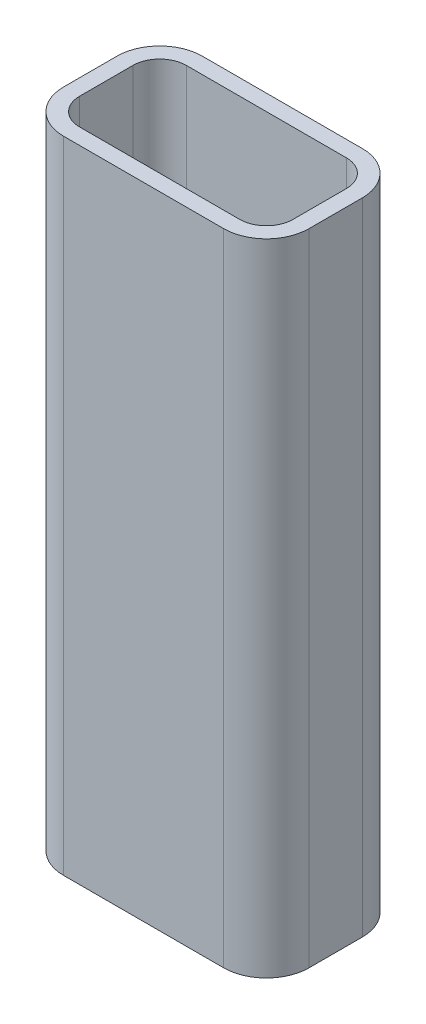
ISO-10303-21;
HEADER;
FILE_DESCRIPTION(('STEP AP214'),'2;1');
FILE_NAME('part.step','',(''),(''),'','','');
FILE_SCHEMA(('AUTOMOTIVE_DESIGN { 1 0 10303 214 1 1 1 1 }'));
ENDSEC;
DATA;
#1=APPLICATION_CONTEXT('core data for automotive mechanical design processes');
#2=APPLICATION_PROTOCOL_DEFINITION('international standard','automotive_design',2000,#1);
#3=PRODUCT_CONTEXT('',#1,'mechanical');
#4=PRODUCT('Part','Part','',(#3));
#5=PRODUCT_RELATED_PRODUCT_CATEGORY('part','',(#4));
#6=PRODUCT_DEFINITION_FORMATION('','',#4);
#7=PRODUCT_DEFINITION_CONTEXT('part definition',#1,'design');
#8=PRODUCT_DEFINITION('design','',#6,#7);
#9=PRODUCT_DEFINITION_SHAPE('','',#8);
#10=(LENGTH_UNIT() NAMED_UNIT(*) SI_UNIT(.MILLI.,.METRE.));
#11=(NAMED_UNIT(*) PLANE_ANGLE_UNIT() SI_UNIT($,.RADIAN.));
#12=(NAMED_UNIT(*) SI_UNIT($,.STERADIAN.) SOLID_ANGLE_UNIT());
#13=UNCERTAINTY_MEASURE_WITH_UNIT(LENGTH_MEASURE(1.E-05),#10,'distance_accuracy_value','');
#14=(GEOMETRIC_REPRESENTATION_CONTEXT(3) GLOBAL_UNCERTAINTY_ASSIGNED_CONTEXT((#13)) GLOBAL_UNIT_ASSIGNED_CONTEXT((#10,
#11,#12)) REPRESENTATION_CONTEXT('',''));
#15=CARTESIAN_POINT('',(0.,0.,0.));
#16=DIRECTION('',(0.,0.,1.));
#17=DIRECTION('',(1.,0.,0.));
#18=AXIS2_PLACEMENT_3D('',#15,#16,#17);
#19=CARTESIAN_POINT('',(15.,60.,5.));
#20=DIRECTION('',(0.,1.,0.));
#21=DIRECTION('',(0.,0.,1.));
#22=AXIS2_PLACEMENT_3D('',#19,#20,#21);
#23=PLANE('',#22);
#24=CARTESIAN_POINT('',(15.,60.,5.));
#25=DIRECTION('',(0.,1.,0.));
#26=DIRECTION('',(1.,0.,0.));
#27=AXIS2_PLACEMENT_3D('',#24,#25,#26);
#28=CIRCLE('',#27,8.);
#29=CARTESIAN_POINT('',(15.,60.,13.));
#30=VERTEX_POINT('',#29);
#31=CARTESIAN_POINT('',(23.,60.,5.));
#32=VERTEX_POINT('',#31);
#33=EDGE_CURVE('E290',#30,#32,#28,.T.);
#34=ORIENTED_EDGE('',*,*,#33,.T.);
#35=DIRECTION('',(0.,0.,-1.));
#36=VECTOR('',#35,1.);
#37=CARTESIAN_POINT('',(23.,60.,5.));
#38=LINE('',#37,#36);
#39=CARTESIAN_POINT('',(23.,60.,-5.));
#40=VERTEX_POINT('',#39);
#41=EDGE_CURVE('E294',#32,#40,#38,.T.);
#42=ORIENTED_EDGE('',*,*,#41,.T.);
#43=CARTESIAN_POINT('',(15.,60.,-5.));
#44=DIRECTION('',(0.,1.,0.));
#45=DIRECTION('',(1.,0.,0.));
#46=AXIS2_PLACEMENT_3D('',#43,#44,#45);
#47=CIRCLE('',#46,8.);
#48=CARTESIAN_POINT('',(15.,60.,-13.));
#49=VERTEX_POINT('',#48);
#50=EDGE_CURVE('E298',#40,#49,#47,.T.);
#51=ORIENTED_EDGE('',*,*,#50,.T.);
#52=DIRECTION('',(-1.,0.,0.));
#53=VECTOR('',#52,1.);
#54=CARTESIAN_POINT('',(-15.,60.,-13.));
#55=LINE('',#54,#53);
#56=CARTESIAN_POINT('',(-15.,60.,-13.));
#57=VERTEX_POINT('',#56);
#58=EDGE_CURVE('E301',#49,#57,#55,.T.);
#59=ORIENTED_EDGE('',*,*,#58,.T.);
#60=CARTESIAN_POINT('',(-15.,60.,-5.));
#61=DIRECTION('',(0.,1.,0.));
#62=DIRECTION('',(1.,0.,0.));
#63=AXIS2_PLACEMENT_3D('',#60,#61,#62);
#64=CIRCLE('',#63,8.);
#65=CARTESIAN_POINT('',(-23.,60.,-5.));
#66=VERTEX_POINT('',#65);
#67=EDGE_CURVE('E304',#57,#66,#64,.T.);
#68=ORIENTED_EDGE('',*,*,#67,.T.);
#69=DIRECTION('',(0.,0.,1.));
#70=VECTOR('',#69,1.);
#71=CARTESIAN_POINT('',(-23.,60.,5.));
#72=LINE('',#71,#70);
#73=CARTESIAN_POINT('',(-23.,60.,5.));
#74=VERTEX_POINT('',#73);
#75=EDGE_CURVE('E307',#66,#74,#72,.T.);
#76=ORIENTED_EDGE('',*,*,#75,.T.);
#77=CARTESIAN_POINT('',(-15.,60.,5.));
#78=DIRECTION('',(0.,1.,0.));
#79=DIRECTION('',(1.,0.,0.));
#80=AXIS2_PLACEMENT_3D('',#77,#78,#79);
#81=CIRCLE('',#80,8.);
#82=CARTESIAN_POINT('',(-15.,60.,13.));
#83=VERTEX_POINT('',#82);
#84=EDGE_CURVE('E310',#74,#83,#81,.T.);
#85=ORIENTED_EDGE('',*,*,#84,.T.);
#86=DIRECTION('',(1.,0.,0.));
#87=VECTOR('',#86,1.);
#88=CARTESIAN_POINT('',(-15.,60.,13.));
#89=LINE('',#88,#87);
#90=EDGE_CURVE('E313',#83,#30,#89,.T.);
#91=ORIENTED_EDGE('',*,*,#90,.T.);
#92=EDGE_LOOP('',(#34,#42,#51,#59,#68,#76,#85,#91));
#93=FACE_BOUND('',#92,.T.);
#94=DIRECTION('',(0.,0.,-1.));
#95=VECTOR('',#94,1.);
#96=CARTESIAN_POINT('',(20.,60.,5.));
#97=LINE('',#96,#95);
#98=CARTESIAN_POINT('',(20.,60.,5.));
#99=VERTEX_POINT('',#98);
#100=CARTESIAN_POINT('',(20.,60.,-5.));
#101=VERTEX_POINT('',#100);
#102=EDGE_CURVE('E210',#99,#101,#97,.T.);
#103=ORIENTED_EDGE('',*,*,#102,.F.);
#104=CARTESIAN_POINT('',(15.,60.,5.));
#105=DIRECTION('',(0.,1.,0.));
#106=DIRECTION('',(0.,0.,1.));
#107=AXIS2_PLACEMENT_3D('',#104,#105,#106);
#108=CIRCLE('',#107,5.);
#109=CARTESIAN_POINT('',(15.,60.,10.));
#110=VERTEX_POINT('',#109);
#111=EDGE_CURVE('E201',#110,#99,#108,.T.);
#112=ORIENTED_EDGE('',*,*,#111,.F.);
#113=DIRECTION('',(1.,0.,0.));
#114=VECTOR('',#113,1.);
#115=CARTESIAN_POINT('',(-15.,60.,10.));
#116=LINE('',#115,#114);
#117=CARTESIAN_POINT('',(-15.,60.,10.));
#118=VERTEX_POINT('',#117);
#119=EDGE_CURVE('E242',#118,#110,#116,.T.);
#120=ORIENTED_EDGE('',*,*,#119,.F.);
#121=CARTESIAN_POINT('',(-15.,60.,5.));
#122=DIRECTION('',(0.,1.,0.));
#123=DIRECTION('',(0.,0.,-1.));
#124=AXIS2_PLACEMENT_3D('',#121,#122,#123);
#125=CIRCLE('',#124,5.);
#126=CARTESIAN_POINT('',(-20.,60.,5.));
#127=VERTEX_POINT('',#126);
#128=EDGE_CURVE('E239',#127,#118,#125,.T.);
#129=ORIENTED_EDGE('',*,*,#128,.F.);
#130=DIRECTION('',(0.,0.,1.));
#131=VECTOR('',#130,1.);
#132=CARTESIAN_POINT('',(-20.,60.,5.));
#133=LINE('',#132,#131);
#134=CARTESIAN_POINT('',(-20.,60.,-5.));
#135=VERTEX_POINT('',#134);
#136=EDGE_CURVE('E236',#135,#127,#133,.T.);
#137=ORIENTED_EDGE('',*,*,#136,.F.);
#138=CARTESIAN_POINT('',(-15.,60.,-5.));
#139=DIRECTION('',(0.,1.,0.));
#140=DIRECTION('',(0.,0.,-1.));
#141=AXIS2_PLACEMENT_3D('',#138,#139,#140);
#142=CIRCLE('',#141,5.);
#143=CARTESIAN_POINT('',(-15.,60.,-10.));
#144=VERTEX_POINT('',#143);
#145=EDGE_CURVE('E233',#144,#135,#142,.T.);
#146=ORIENTED_EDGE('',*,*,#145,.F.);
#147=DIRECTION('',(-1.,0.,0.));
#148=VECTOR('',#147,1.);
#149=CARTESIAN_POINT('',(-15.,60.,-10.));
#150=LINE('',#149,#148);
#151=CARTESIAN_POINT('',(15.,60.,-10.));
#152=VERTEX_POINT('',#151);
#153=EDGE_CURVE('E228',#152,#144,#150,.T.);
#154=ORIENTED_EDGE('',*,*,#153,.F.);
#155=CARTESIAN_POINT('',(15.,60.,-5.));
#156=DIRECTION('',(0.,1.,0.));
#157=DIRECTION('',(0.,0.,-1.));
#158=AXIS2_PLACEMENT_3D('',#155,#156,#157);
#159=CIRCLE('',#158,5.);
#160=EDGE_CURVE('E224',#101,#152,#159,.T.);
#161=ORIENTED_EDGE('',*,*,#160,.F.);
#162=EDGE_LOOP('',(#103,#112,#120,#129,#137,#146,#154,#161));
#163=FACE_BOUND('',#162,.T.);
#164=ADVANCED_FACE('F87',(#93,#163),#23,.T.);
#165=CARTESIAN_POINT('',(15.,-60.,5.));
#166=DIRECTION('',(0.,1.,0.));
#167=DIRECTION('',(0.,0.,1.));
#168=AXIS2_PLACEMENT_3D('',#165,#166,#167);
#169=PLANE('',#168);
#170=CARTESIAN_POINT('',(15.,-60.,5.));
#171=DIRECTION('',(0.,1.,0.));
#172=DIRECTION('',(1.,0.,0.));
#173=AXIS2_PLACEMENT_3D('',#170,#171,#172);
#174=CIRCLE('',#173,8.);
#175=CARTESIAN_POINT('',(15.,-60.,13.));
#176=VERTEX_POINT('',#175);
#177=CARTESIAN_POINT('',(23.,-60.,5.));
#178=VERTEX_POINT('',#177);
#179=EDGE_CURVE('E219',#176,#178,#174,.T.);
#180=ORIENTED_EDGE('',*,*,#179,.F.);
#181=DIRECTION('',(1.,0.,0.));
#182=VECTOR('',#181,1.);
#183=CARTESIAN_POINT('',(-15.,-60.,13.));
#184=LINE('',#183,#182);
#185=CARTESIAN_POINT('',(-15.,-60.,13.));
#186=VERTEX_POINT('',#185);
#187=EDGE_CURVE('E295',#186,#176,#184,.T.);
#188=ORIENTED_EDGE('',*,*,#187,.F.);
#189=CARTESIAN_POINT('',(-15.,-60.,5.));
#190=DIRECTION('',(0.,1.,0.));
#191=DIRECTION('',(1.,0.,0.));
#192=AXIS2_PLACEMENT_3D('',#189,#190,#191);
#193=CIRCLE('',#192,8.);
#194=CARTESIAN_POINT('',(-23.,-60.,5.));
#195=VERTEX_POINT('',#194);
#196=EDGE_CURVE('E335',#195,#186,#193,.T.);
#197=ORIENTED_EDGE('',*,*,#196,.F.);
#198=DIRECTION('',(0.,0.,1.));
#199=VECTOR('',#198,1.);
#200=CARTESIAN_POINT('',(-23.,-60.,5.));
#201=LINE('',#200,#199);
#202=CARTESIAN_POINT('',(-23.,-60.,-5.));
#203=VERTEX_POINT('',#202);
#204=EDGE_CURVE('E332',#203,#195,#201,.T.);
#205=ORIENTED_EDGE('',*,*,#204,.F.);
#206=CARTESIAN_POINT('',(-15.,-60.,-5.));
#207=DIRECTION('',(0.,1.,0.));
#208=DIRECTION('',(1.,0.,0.));
#209=AXIS2_PLACEMENT_3D('',#206,#207,#208);
#210=CIRCLE('',#209,8.);
#211=CARTESIAN_POINT('',(-15.,-60.,-13.));
#212=VERTEX_POINT('',#211);
#213=EDGE_CURVE('E329',#212,#203,#210,.T.);
#214=ORIENTED_EDGE('',*,*,#213,.F.);
#215=DIRECTION('',(-1.,0.,0.));
#216=VECTOR('',#215,1.);
#217=CARTESIAN_POINT('',(-15.,-60.,-13.));
#218=LINE('',#217,#216);
#219=CARTESIAN_POINT('',(15.,-60.,-13.));
#220=VERTEX_POINT('',#219);
#221=EDGE_CURVE('E326',#220,#212,#218,.T.);
#222=ORIENTED_EDGE('',*,*,#221,.F.);
#223=CARTESIAN_POINT('',(15.,-60.,-5.));
#224=DIRECTION('',(0.,1.,0.));
#225=DIRECTION('',(1.,0.,0.));
#226=AXIS2_PLACEMENT_3D('',#223,#224,#225);
#227=CIRCLE('',#226,8.);
#228=CARTESIAN_POINT('',(23.,-60.,-5.));
#229=VERTEX_POINT('',#228);
#230=EDGE_CURVE('E323',#229,#220,#227,.T.);
#231=ORIENTED_EDGE('',*,*,#230,.F.);
#232=DIRECTION('',(0.,0.,-1.));
#233=VECTOR('',#232,1.);
#234=CARTESIAN_POINT('',(23.,-60.,5.));
#235=LINE('',#234,#233);
#236=EDGE_CURVE('E320',#178,#229,#235,.T.);
#237=ORIENTED_EDGE('',*,*,#236,.F.);
#238=EDGE_LOOP('',(#180,#188,#197,#205,#214,#222,#231,#237));
#239=FACE_BOUND('',#238,.T.);
#240=CARTESIAN_POINT('',(15.,-60.,5.));
#241=DIRECTION('',(0.,1.,0.));
#242=DIRECTION('',(0.,0.,1.));
#243=AXIS2_PLACEMENT_3D('',#240,#241,#242);
#244=CIRCLE('',#243,5.);
#245=CARTESIAN_POINT('',(15.,-60.,10.));
#246=VERTEX_POINT('',#245);
#247=CARTESIAN_POINT('',(20.,-60.,5.));
#248=VERTEX_POINT('',#247);
#249=EDGE_CURVE('E111',#246,#248,#244,.T.);
#250=ORIENTED_EDGE('',*,*,#249,.T.);
#251=DIRECTION('',(0.,0.,-1.));
#252=VECTOR('',#251,1.);
#253=CARTESIAN_POINT('',(20.,-60.,5.));
#254=LINE('',#253,#252);
#255=CARTESIAN_POINT('',(20.,-60.,-5.));
#256=VERTEX_POINT('',#255);
#257=EDGE_CURVE('E217',#248,#256,#254,.T.);
#258=ORIENTED_EDGE('',*,*,#257,.T.);
#259=CARTESIAN_POINT('',(15.,-60.,-5.));
#260=DIRECTION('',(0.,1.,0.));
#261=DIRECTION('',(0.,0.,-1.));
#262=AXIS2_PLACEMENT_3D('',#259,#260,#261);
#263=CIRCLE('',#262,5.);
#264=CARTESIAN_POINT('',(15.,-60.,-10.));
#265=VERTEX_POINT('',#264);
#266=EDGE_CURVE('E249',#256,#265,#263,.T.);
#267=ORIENTED_EDGE('',*,*,#266,.T.);
#268=DIRECTION('',(-1.,0.,0.));
#269=VECTOR('',#268,1.);
#270=CARTESIAN_POINT('',(-15.,-60.,-10.));
#271=LINE('',#270,#269);
#272=CARTESIAN_POINT('',(-15.,-60.,-10.));
#273=VERTEX_POINT('',#272);
#274=EDGE_CURVE('E253',#265,#273,#271,.T.);
#275=ORIENTED_EDGE('',*,*,#274,.T.);
#276=CARTESIAN_POINT('',(-15.,-60.,-5.));
#277=DIRECTION('',(0.,1.,0.));
#278=DIRECTION('',(0.,0.,-1.));
#279=AXIS2_PLACEMENT_3D('',#276,#277,#278);
#280=CIRCLE('',#279,5.);
#281=CARTESIAN_POINT('',(-20.,-60.,-5.));
#282=VERTEX_POINT('',#281);
#283=EDGE_CURVE('E257',#273,#282,#280,.T.);
#284=ORIENTED_EDGE('',*,*,#283,.T.);
#285=DIRECTION('',(0.,0.,1.));
#286=VECTOR('',#285,1.);
#287=CARTESIAN_POINT('',(-20.,-60.,5.));
#288=LINE('',#287,#286);
#289=CARTESIAN_POINT('',(-20.,-60.,5.));
#290=VERTEX_POINT('',#289);
#291=EDGE_CURVE('E261',#282,#290,#288,.T.);
#292=ORIENTED_EDGE('',*,*,#291,.T.);
#293=CARTESIAN_POINT('',(-15.,-60.,5.));
#294=DIRECTION('',(0.,1.,0.));
#295=DIRECTION('',(0.,0.,-1.));
#296=AXIS2_PLACEMENT_3D('',#293,#294,#295);
#297=CIRCLE('',#296,5.);
#298=CARTESIAN_POINT('',(-15.,-60.,10.));
#299=VERTEX_POINT('',#298);
#300=EDGE_CURVE('E265',#290,#299,#297,.T.);
#301=ORIENTED_EDGE('',*,*,#300,.T.);
#302=DIRECTION('',(1.,0.,0.));
#303=VECTOR('',#302,1.);
#304=CARTESIAN_POINT('',(-15.,-60.,10.));
#305=LINE('',#304,#303);
#306=EDGE_CURVE('E211',#299,#246,#305,.T.);
#307=ORIENTED_EDGE('',*,*,#306,.T.);
#308=EDGE_LOOP('',(#250,#258,#267,#275,#284,#292,#301,#307));
#309=FACE_BOUND('',#308,.T.);
#310=ADVANCED_FACE('F374',(#239,#309),#169,.F.);
#311=CARTESIAN_POINT('',(15.,60.,5.));
#312=DIRECTION('',(0.,-1.,0.));
#313=DIRECTION('',(0.,0.,-1.));
#314=AXIS2_PLACEMENT_3D('',#311,#312,#313);
#315=CYLINDRICAL_SURFACE('',#314,8.);
#316=ORIENTED_EDGE('',*,*,#179,.T.);
#317=DIRECTION('',(0.,-1.,0.));
#318=VECTOR('',#317,1.);
#319=CARTESIAN_POINT('',(23.,60.,5.));
#320=LINE('',#319,#318);
#321=EDGE_CURVE('E12',#32,#178,#320,.T.);
#322=ORIENTED_EDGE('',*,*,#321,.F.);
#323=ORIENTED_EDGE('',*,*,#33,.F.);
#324=DIRECTION('',(0.,-1.,0.));
#325=VECTOR('',#324,1.);
#326=CARTESIAN_POINT('',(15.,60.,13.));
#327=LINE('',#326,#325);
#328=EDGE_CURVE('E316',#30,#176,#327,.T.);
#329=ORIENTED_EDGE('',*,*,#328,.T.);
#330=EDGE_LOOP('',(#316,#322,#323,#329));
#331=FACE_BOUND('',#330,.T.);
#332=ADVANCED_FACE('F89',(#331),#315,.T.);
#333=CARTESIAN_POINT('',(23.,60.,5.));
#334=DIRECTION('',(-1.,0.,0.));
#335=DIRECTION('',(0.,0.,1.));
#336=AXIS2_PLACEMENT_3D('',#333,#334,#335);
#337=PLANE('',#336);
#338=ORIENTED_EDGE('',*,*,#236,.T.);
#339=DIRECTION('',(0.,-1.,0.));
#340=VECTOR('',#339,1.);
#341=CARTESIAN_POINT('',(23.,60.,-5.));
#342=LINE('',#341,#340);
#343=EDGE_CURVE('E96',#40,#229,#342,.T.);
#344=ORIENTED_EDGE('',*,*,#343,.F.);
#345=ORIENTED_EDGE('',*,*,#41,.F.);
#346=ORIENTED_EDGE('',*,*,#321,.T.);
#347=EDGE_LOOP('',(#338,#344,#345,#346));
#348=FACE_BOUND('',#347,.T.);
#349=ADVANCED_FACE('F391',(#348),#337,.F.);
#350=CARTESIAN_POINT('',(15.,60.,-5.));
#351=DIRECTION('',(0.,-1.,0.));
#352=DIRECTION('',(0.,0.,-1.));
#353=AXIS2_PLACEMENT_3D('',#350,#351,#352);
#354=CYLINDRICAL_SURFACE('',#353,8.);
#355=ORIENTED_EDGE('',*,*,#230,.T.);
#356=DIRECTION('',(0.,-1.,0.));
#357=VECTOR('',#356,1.);
#358=CARTESIAN_POINT('',(15.,60.,-13.));
#359=LINE('',#358,#357);
#360=EDGE_CURVE('E359',#49,#220,#359,.T.);
#361=ORIENTED_EDGE('',*,*,#360,.F.);
#362=ORIENTED_EDGE('',*,*,#50,.F.);
#363=ORIENTED_EDGE('',*,*,#343,.T.);
#364=EDGE_LOOP('',(#355,#361,#362,#363));
#365=FACE_BOUND('',#364,.T.);
#366=ADVANCED_FACE('F368',(#365),#354,.T.);
#367=CARTESIAN_POINT('',(-15.,60.,-13.));
#368=DIRECTION('',(0.,0.,1.));
#369=DIRECTION('',(1.,0.,0.));
#370=AXIS2_PLACEMENT_3D('',#367,#368,#369);
#371=PLANE('',#370);
#372=ORIENTED_EDGE('',*,*,#221,.T.);
#373=DIRECTION('',(0.,-1.,0.));
#374=VECTOR('',#373,1.);
#375=CARTESIAN_POINT('',(-15.,60.,-13.));
#376=LINE('',#375,#374);
#377=EDGE_CURVE('E355',#57,#212,#376,.T.);
#378=ORIENTED_EDGE('',*,*,#377,.F.);
#379=ORIENTED_EDGE('',*,*,#58,.F.);
#380=ORIENTED_EDGE('',*,*,#360,.T.);
#381=EDGE_LOOP('',(#372,#378,#379,#380));
#382=FACE_BOUND('',#381,.T.);
#383=ADVANCED_FACE('F380',(#382),#371,.F.);
#384=CARTESIAN_POINT('',(-15.,60.,-5.));
#385=DIRECTION('',(0.,-1.,0.));
#386=DIRECTION('',(0.,0.,-1.));
#387=AXIS2_PLACEMENT_3D('',#384,#385,#386);
#388=CYLINDRICAL_SURFACE('',#387,8.);
#389=ORIENTED_EDGE('',*,*,#213,.T.);
#390=DIRECTION('',(0.,-1.,0.));
#391=VECTOR('',#390,1.);
#392=CARTESIAN_POINT('',(-23.,60.,-5.));
#393=LINE('',#392,#391);
#394=EDGE_CURVE('E351',#66,#203,#393,.T.);
#395=ORIENTED_EDGE('',*,*,#394,.F.);
#396=ORIENTED_EDGE('',*,*,#67,.F.);
#397=ORIENTED_EDGE('',*,*,#377,.T.);
#398=EDGE_LOOP('',(#389,#395,#396,#397));
#399=FACE_BOUND('',#398,.T.);
#400=ADVANCED_FACE('F384',(#399),#388,.T.);
#401=CARTESIAN_POINT('',(-23.,60.,5.));
#402=DIRECTION('',(1.,0.,0.));
#403=DIRECTION('',(0.,0.,-1.));
#404=AXIS2_PLACEMENT_3D('',#401,#402,#403);
#405=PLANE('',#404);
#406=ORIENTED_EDGE('',*,*,#204,.T.);
#407=DIRECTION('',(0.,-1.,0.));
#408=VECTOR('',#407,1.);
#409=CARTESIAN_POINT('',(-23.,60.,5.));
#410=LINE('',#409,#408);
#411=EDGE_CURVE('E347',#74,#195,#410,.T.);
#412=ORIENTED_EDGE('',*,*,#411,.F.);
#413=ORIENTED_EDGE('',*,*,#75,.F.);
#414=ORIENTED_EDGE('',*,*,#394,.T.);
#415=EDGE_LOOP('',(#406,#412,#413,#414));
#416=FACE_BOUND('',#415,.T.);
#417=ADVANCED_FACE('F404',(#416),#405,.F.);
#418=CARTESIAN_POINT('',(-15.,60.,5.));
#419=DIRECTION('',(0.,-1.,0.));
#420=DIRECTION('',(0.,0.,-1.));
#421=AXIS2_PLACEMENT_3D('',#418,#419,#420);
#422=CYLINDRICAL_SURFACE('',#421,8.);
#423=ORIENTED_EDGE('',*,*,#196,.T.);
#424=DIRECTION('',(0.,-1.,0.));
#425=VECTOR('',#424,1.);
#426=CARTESIAN_POINT('',(-15.,60.,13.));
#427=LINE('',#426,#425);
#428=EDGE_CURVE('E343',#83,#186,#427,.T.);
#429=ORIENTED_EDGE('',*,*,#428,.F.);
#430=ORIENTED_EDGE('',*,*,#84,.F.);
#431=ORIENTED_EDGE('',*,*,#411,.T.);
#432=EDGE_LOOP('',(#423,#429,#430,#431));
#433=FACE_BOUND('',#432,.T.);
#434=ADVANCED_FACE('F402',(#433),#422,.T.);
#435=CARTESIAN_POINT('',(-15.,60.,13.));
#436=DIRECTION('',(0.,0.,-1.));
#437=DIRECTION('',(-1.,0.,0.));
#438=AXIS2_PLACEMENT_3D('',#435,#436,#437);
#439=PLANE('',#438);
#440=ORIENTED_EDGE('',*,*,#187,.T.);
#441=ORIENTED_EDGE('',*,*,#328,.F.);
#442=ORIENTED_EDGE('',*,*,#90,.F.);
#443=ORIENTED_EDGE('',*,*,#428,.T.);
#444=EDGE_LOOP('',(#440,#441,#442,#443));
#445=FACE_BOUND('',#444,.T.);
#446=ADVANCED_FACE('F397',(#445),#439,.F.);
#447=CARTESIAN_POINT('',(15.,60.,5.));
#448=DIRECTION('',(0.,-1.,0.));
#449=DIRECTION('',(0.,0.,-1.));
#450=AXIS2_PLACEMENT_3D('',#447,#448,#449);
#451=CYLINDRICAL_SURFACE('',#450,5.);
#452=ORIENTED_EDGE('',*,*,#249,.F.);
#453=DIRECTION('',(0.,-1.,0.));
#454=VECTOR('',#453,1.);
#455=CARTESIAN_POINT('',(15.,60.,10.));
#456=LINE('',#455,#454);
#457=EDGE_CURVE('E205',#110,#246,#456,.T.);
#458=ORIENTED_EDGE('',*,*,#457,.F.);
#459=ORIENTED_EDGE('',*,*,#111,.T.);
#460=DIRECTION('',(0.,-1.,0.));
#461=VECTOR('',#460,1.);
#462=CARTESIAN_POINT('',(20.,60.,5.));
#463=LINE('',#462,#461);
#464=EDGE_CURVE('E204',#99,#248,#463,.T.);
#465=ORIENTED_EDGE('',*,*,#464,.T.);
#466=EDGE_LOOP('',(#452,#458,#459,#465));
#467=FACE_BOUND('',#466,.T.);
#468=ADVANCED_FACE('F203',(#467),#451,.F.);
#469=CARTESIAN_POINT('',(20.,60.,5.));
#470=DIRECTION('',(-1.,0.,0.));
#471=DIRECTION('',(0.,0.,1.));
#472=AXIS2_PLACEMENT_3D('',#469,#470,#471);
#473=PLANE('',#472);
#474=ORIENTED_EDGE('',*,*,#257,.F.);
#475=ORIENTED_EDGE('',*,*,#464,.F.);
#476=ORIENTED_EDGE('',*,*,#102,.T.);
#477=DIRECTION('',(0.,-1.,0.));
#478=VECTOR('',#477,1.);
#479=CARTESIAN_POINT('',(20.,60.,-5.));
#480=LINE('',#479,#478);
#481=EDGE_CURVE('E220',#101,#256,#480,.T.);
#482=ORIENTED_EDGE('',*,*,#481,.T.);
#483=EDGE_LOOP('',(#474,#475,#476,#482));
#484=FACE_BOUND('',#483,.T.);
#485=ADVANCED_FACE('F214',(#484),#473,.T.);
#486=CARTESIAN_POINT('',(15.,60.,-5.));
#487=DIRECTION('',(0.,-1.,0.));
#488=DIRECTION('',(0.,0.,-1.));
#489=AXIS2_PLACEMENT_3D('',#486,#487,#488);
#490=CYLINDRICAL_SURFACE('',#489,5.);
#491=ORIENTED_EDGE('',*,*,#266,.F.);
#492=ORIENTED_EDGE('',*,*,#481,.F.);
#493=ORIENTED_EDGE('',*,*,#160,.T.);
#494=DIRECTION('',(0.,-1.,0.));
#495=VECTOR('',#494,1.);
#496=CARTESIAN_POINT('',(15.,60.,-10.));
#497=LINE('',#496,#495);
#498=EDGE_CURVE('E285',#152,#265,#497,.T.);
#499=ORIENTED_EDGE('',*,*,#498,.T.);
#500=EDGE_LOOP('',(#491,#492,#493,#499));
#501=FACE_BOUND('',#500,.T.);
#502=ADVANCED_FACE('F429',(#501),#490,.F.);
#503=CARTESIAN_POINT('',(-15.,60.,-10.));
#504=DIRECTION('',(0.,0.,1.));
#505=DIRECTION('',(1.,0.,0.));
#506=AXIS2_PLACEMENT_3D('',#503,#504,#505);
#507=PLANE('',#506);
#508=ORIENTED_EDGE('',*,*,#274,.F.);
#509=ORIENTED_EDGE('',*,*,#498,.F.);
#510=ORIENTED_EDGE('',*,*,#153,.T.);
#511=DIRECTION('',(0.,-1.,0.));
#512=VECTOR('',#511,1.);
#513=CARTESIAN_POINT('',(-15.,60.,-10.));
#514=LINE('',#513,#512);
#515=EDGE_CURVE('E282',#144,#273,#514,.T.);
#516=ORIENTED_EDGE('',*,*,#515,.T.);
#517=EDGE_LOOP('',(#508,#509,#510,#516));
#518=FACE_BOUND('',#517,.T.);
#519=ADVANCED_FACE('F433',(#518),#507,.T.);
#520=CARTESIAN_POINT('',(-15.,60.,-5.));
#521=DIRECTION('',(0.,-1.,0.));
#522=DIRECTION('',(0.,0.,-1.));
#523=AXIS2_PLACEMENT_3D('',#520,#521,#522);
#524=CYLINDRICAL_SURFACE('',#523,5.);
#525=ORIENTED_EDGE('',*,*,#283,.F.);
#526=ORIENTED_EDGE('',*,*,#515,.F.);
#527=ORIENTED_EDGE('',*,*,#145,.T.);
#528=DIRECTION('',(0.,-1.,0.));
#529=VECTOR('',#528,1.);
#530=CARTESIAN_POINT('',(-20.,60.,-5.));
#531=LINE('',#530,#529);
#532=EDGE_CURVE('E279',#135,#282,#531,.T.);
#533=ORIENTED_EDGE('',*,*,#532,.T.);
#534=EDGE_LOOP('',(#525,#526,#527,#533));
#535=FACE_BOUND('',#534,.T.);
#536=ADVANCED_FACE('F439',(#535),#524,.F.);
#537=CARTESIAN_POINT('',(-20.,60.,5.));
#538=DIRECTION('',(1.,0.,0.));
#539=DIRECTION('',(0.,0.,-1.));
#540=AXIS2_PLACEMENT_3D('',#537,#538,#539);
#541=PLANE('',#540);
#542=ORIENTED_EDGE('',*,*,#291,.F.);
#543=ORIENTED_EDGE('',*,*,#532,.F.);
#544=ORIENTED_EDGE('',*,*,#136,.T.);
#545=DIRECTION('',(0.,-1.,0.));
#546=VECTOR('',#545,1.);
#547=CARTESIAN_POINT('',(-20.,60.,5.));
#548=LINE('',#547,#546);
#549=EDGE_CURVE('E276',#127,#290,#548,.T.);
#550=ORIENTED_EDGE('',*,*,#549,.T.);
#551=EDGE_LOOP('',(#542,#543,#544,#550));
#552=FACE_BOUND('',#551,.T.);
#553=ADVANCED_FACE('F443',(#552),#541,.T.);
#554=CARTESIAN_POINT('',(-15.,60.,5.));
#555=DIRECTION('',(0.,-1.,0.));
#556=DIRECTION('',(0.,0.,-1.));
#557=AXIS2_PLACEMENT_3D('',#554,#555,#556);
#558=CYLINDRICAL_SURFACE('',#557,5.);
#559=ORIENTED_EDGE('',*,*,#300,.F.);
#560=ORIENTED_EDGE('',*,*,#549,.F.);
#561=ORIENTED_EDGE('',*,*,#128,.T.);
#562=DIRECTION('',(0.,-1.,0.));
#563=VECTOR('',#562,1.);
#564=CARTESIAN_POINT('',(-15.,60.,10.));
#565=LINE('',#564,#563);
#566=EDGE_CURVE('E103',#118,#299,#565,.T.);
#567=ORIENTED_EDGE('',*,*,#566,.T.);
#568=EDGE_LOOP('',(#559,#560,#561,#567));
#569=FACE_BOUND('',#568,.T.);
#570=ADVANCED_FACE('F447',(#569),#558,.F.);
#571=CARTESIAN_POINT('',(-15.,60.,10.));
#572=DIRECTION('',(0.,0.,-1.));
#573=DIRECTION('',(-1.,0.,0.));
#574=AXIS2_PLACEMENT_3D('',#571,#572,#573);
#575=PLANE('',#574);
#576=ORIENTED_EDGE('',*,*,#306,.F.);
#577=ORIENTED_EDGE('',*,*,#566,.F.);
#578=ORIENTED_EDGE('',*,*,#119,.T.);
#579=ORIENTED_EDGE('',*,*,#457,.T.);
#580=EDGE_LOOP('',(#576,#577,#578,#579));
#581=FACE_BOUND('',#580,.T.);
#582=ADVANCED_FACE('F451',(#581),#575,.T.);
#583=CLOSED_SHELL('',(#164,#310,#332,#349,#366,#383,#400,#417,#434,#446,#468,#485,#502,#519,
#536,#553,#570,#582));
#584=MANIFOLD_SOLID_BREP('B2',#583);
#585=ADVANCED_BREP_SHAPE_REPRESENTATION('',(#18,#584),#14);
#586=SHAPE_DEFINITION_REPRESENTATION(#9,#585);
ENDSEC;
END-ISO-10303-21;
